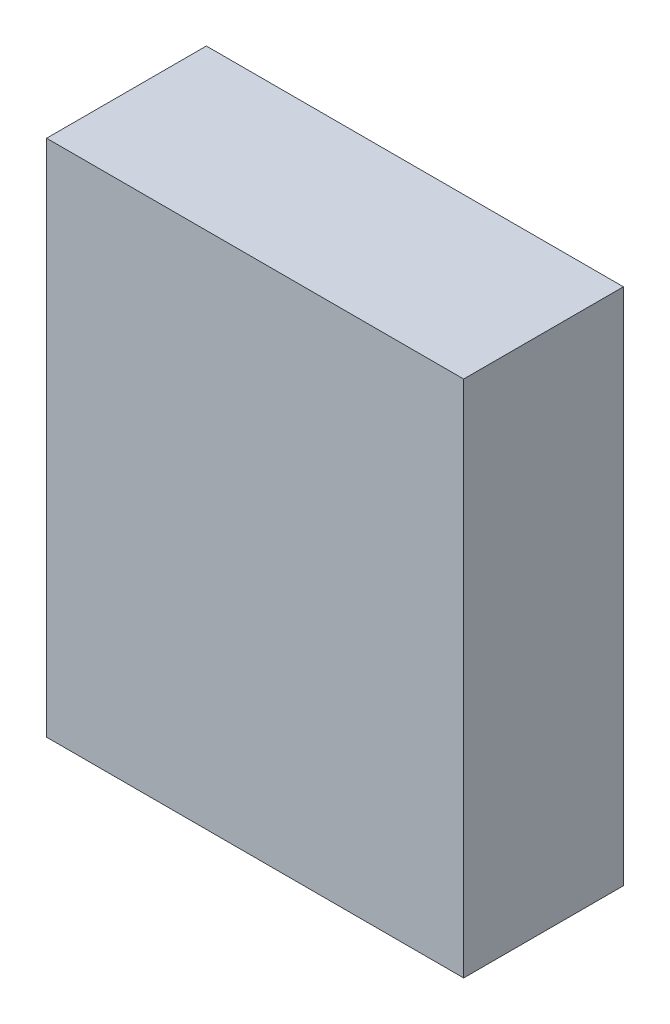
ISO-10303-21;
HEADER;
FILE_DESCRIPTION(('STEP AP214'),'2;1');
FILE_NAME('part.step','',(''),(''),'','','');
FILE_SCHEMA(('AUTOMOTIVE_DESIGN { 1 0 10303 214 1 1 1 1 }'));
ENDSEC;
DATA;
#1=APPLICATION_CONTEXT('core data for automotive mechanical design processes');
#2=APPLICATION_PROTOCOL_DEFINITION('international standard','automotive_design',2000,#1);
#3=PRODUCT_CONTEXT('',#1,'mechanical');
#4=PRODUCT('Part','Part','',(#3));
#5=PRODUCT_RELATED_PRODUCT_CATEGORY('part','',(#4));
#6=PRODUCT_DEFINITION_FORMATION('','',#4);
#7=PRODUCT_DEFINITION_CONTEXT('part definition',#1,'design');
#8=PRODUCT_DEFINITION('design','',#6,#7);
#9=PRODUCT_DEFINITION_SHAPE('','',#8);
#10=(LENGTH_UNIT() NAMED_UNIT(*) SI_UNIT(.MILLI.,.METRE.));
#11=(NAMED_UNIT(*) PLANE_ANGLE_UNIT() SI_UNIT($,.RADIAN.));
#12=(NAMED_UNIT(*) SI_UNIT($,.STERADIAN.) SOLID_ANGLE_UNIT());
#13=UNCERTAINTY_MEASURE_WITH_UNIT(LENGTH_MEASURE(1.E-05),#10,'distance_accuracy_value','');
#14=(GEOMETRIC_REPRESENTATION_CONTEXT(3) GLOBAL_UNCERTAINTY_ASSIGNED_CONTEXT((#13)) GLOBAL_UNIT_ASSIGNED_CONTEXT((#10,
#11,#12)) REPRESENTATION_CONTEXT('',''));
#15=CARTESIAN_POINT('',(0.,0.,0.));
#16=DIRECTION('',(0.,0.,1.));
#17=DIRECTION('',(1.,0.,0.));
#18=AXIS2_PLACEMENT_3D('',#15,#16,#17);
#19=CARTESIAN_POINT('',(-1.3055,-1.592,1.));
#20=DIRECTION('',(1.,0.,0.));
#21=DIRECTION('',(0.,0.,-1.));
#22=AXIS2_PLACEMENT_3D('',#19,#20,#21);
#23=PLANE('',#22);
#24=DIRECTION('',(0.,-1.,0.));
#25=VECTOR('',#24,1.);
#26=CARTESIAN_POINT('',(-1.3055,-1.592,0.));
#27=LINE('',#26,#25);
#28=CARTESIAN_POINT('',(-1.3055,1.6555,0.));
#29=VERTEX_POINT('',#28);
#30=CARTESIAN_POINT('',(-1.3055,-1.592,0.));
#31=VERTEX_POINT('',#30);
#32=EDGE_CURVE('E95',#29,#31,#27,.T.);
#33=ORIENTED_EDGE('',*,*,#32,.T.);
#34=DIRECTION('',(0.,0.,-1.));
#35=VECTOR('',#34,1.);
#36=CARTESIAN_POINT('',(-1.3055,-1.592,1.));
#37=LINE('',#36,#35);
#38=CARTESIAN_POINT('',(-1.3055,-1.592,1.));
#39=VERTEX_POINT('',#38);
#40=EDGE_CURVE('E11',#39,#31,#37,.T.);
#41=ORIENTED_EDGE('',*,*,#40,.F.);
#42=DIRECTION('',(0.,-1.,0.));
#43=VECTOR('',#42,1.);
#44=CARTESIAN_POINT('',(-1.3055,-1.592,1.));
#45=LINE('',#44,#43);
#46=CARTESIAN_POINT('',(-1.3055,1.6555,1.));
#47=VERTEX_POINT('',#46);
#48=EDGE_CURVE('E83',#47,#39,#45,.T.);
#49=ORIENTED_EDGE('',*,*,#48,.F.);
#50=DIRECTION('',(0.,0.,-1.));
#51=VECTOR('',#50,1.);
#52=CARTESIAN_POINT('',(-1.3055,1.6555,1.));
#53=LINE('',#52,#51);
#54=EDGE_CURVE('E91',#47,#29,#53,.T.);
#55=ORIENTED_EDGE('',*,*,#54,.T.);
#56=EDGE_LOOP('',(#33,#41,#49,#55));
#57=FACE_BOUND('',#56,.T.);
#58=ADVANCED_FACE('F32',(#57),#23,.F.);
#59=CARTESIAN_POINT('',(1.3055,-1.592,1.));
#60=DIRECTION('',(0.,1.,0.));
#61=DIRECTION('',(0.,0.,1.));
#62=AXIS2_PLACEMENT_3D('',#59,#60,#61);
#63=PLANE('',#62);
#64=DIRECTION('',(1.,0.,0.));
#65=VECTOR('',#64,1.);
#66=CARTESIAN_POINT('',(1.3055,-1.592,0.));
#67=LINE('',#66,#65);
#68=CARTESIAN_POINT('',(1.3055,-1.592,0.));
#69=VERTEX_POINT('',#68);
#70=EDGE_CURVE('E87',#31,#69,#67,.T.);
#71=ORIENTED_EDGE('',*,*,#70,.T.);
#72=DIRECTION('',(0.,0.,-1.));
#73=VECTOR('',#72,1.);
#74=CARTESIAN_POINT('',(1.3055,-1.592,1.));
#75=LINE('',#74,#73);
#76=CARTESIAN_POINT('',(1.3055,-1.592,1.));
#77=VERTEX_POINT('',#76);
#78=EDGE_CURVE('E40',#77,#69,#75,.T.);
#79=ORIENTED_EDGE('',*,*,#78,.F.);
#80=DIRECTION('',(1.,0.,0.));
#81=VECTOR('',#80,1.);
#82=CARTESIAN_POINT('',(1.3055,-1.592,1.));
#83=LINE('',#82,#81);
#84=EDGE_CURVE('E78',#39,#77,#83,.T.);
#85=ORIENTED_EDGE('',*,*,#84,.F.);
#86=ORIENTED_EDGE('',*,*,#40,.T.);
#87=EDGE_LOOP('',(#71,#79,#85,#86));
#88=FACE_BOUND('',#87,.T.);
#89=ADVANCED_FACE('F86',(#88),#63,.F.);
#90=CARTESIAN_POINT('',(1.3055,1.6555,1.));
#91=DIRECTION('',(-1.,0.,0.));
#92=DIRECTION('',(0.,0.,1.));
#93=AXIS2_PLACEMENT_3D('',#90,#91,#92);
#94=PLANE('',#93);
#95=DIRECTION('',(0.,1.,0.));
#96=VECTOR('',#95,1.);
#97=CARTESIAN_POINT('',(1.3055,1.6555,0.));
#98=LINE('',#97,#96);
#99=CARTESIAN_POINT('',(1.3055,1.6555,0.));
#100=VERTEX_POINT('',#99);
#101=EDGE_CURVE('E65',#69,#100,#98,.T.);
#102=ORIENTED_EDGE('',*,*,#101,.T.);
#103=DIRECTION('',(0.,0.,-1.));
#104=VECTOR('',#103,1.);
#105=CARTESIAN_POINT('',(1.3055,1.6555,1.));
#106=LINE('',#105,#104);
#107=CARTESIAN_POINT('',(1.3055,1.6555,1.));
#108=VERTEX_POINT('',#107);
#109=EDGE_CURVE('E88',#108,#100,#106,.T.);
#110=ORIENTED_EDGE('',*,*,#109,.F.);
#111=DIRECTION('',(0.,1.,0.));
#112=VECTOR('',#111,1.);
#113=CARTESIAN_POINT('',(1.3055,1.6555,1.));
#114=LINE('',#113,#112);
#115=EDGE_CURVE('E81',#77,#108,#114,.T.);
#116=ORIENTED_EDGE('',*,*,#115,.F.);
#117=ORIENTED_EDGE('',*,*,#78,.T.);
#118=EDGE_LOOP('',(#102,#110,#116,#117));
#119=FACE_BOUND('',#118,.T.);
#120=ADVANCED_FACE('F89',(#119),#94,.F.);
#121=CARTESIAN_POINT('',(-1.3055,1.6555,1.));
#122=DIRECTION('',(0.,-1.,0.));
#123=DIRECTION('',(0.,0.,-1.));
#124=AXIS2_PLACEMENT_3D('',#121,#122,#123);
#125=PLANE('',#124);
#126=DIRECTION('',(-1.,0.,0.));
#127=VECTOR('',#126,1.);
#128=CARTESIAN_POINT('',(-1.3055,1.6555,0.));
#129=LINE('',#128,#127);
#130=EDGE_CURVE('E71',#100,#29,#129,.T.);
#131=ORIENTED_EDGE('',*,*,#130,.T.);
#132=ORIENTED_EDGE('',*,*,#54,.F.);
#133=DIRECTION('',(-1.,0.,0.));
#134=VECTOR('',#133,1.);
#135=CARTESIAN_POINT('',(-1.3055,1.6555,1.));
#136=LINE('',#135,#134);
#137=EDGE_CURVE('E48',#108,#47,#136,.T.);
#138=ORIENTED_EDGE('',*,*,#137,.F.);
#139=ORIENTED_EDGE('',*,*,#109,.T.);
#140=EDGE_LOOP('',(#131,#132,#138,#139));
#141=FACE_BOUND('',#140,.T.);
#142=ADVANCED_FACE('F102',(#141),#125,.F.);
#143=CARTESIAN_POINT('',(0.,0.,1.));
#144=DIRECTION('',(0.,0.,-1.));
#145=DIRECTION('',(-1.,0.,0.));
#146=AXIS2_PLACEMENT_3D('',#143,#144,#145);
#147=PLANE('',#146);
#148=ORIENTED_EDGE('',*,*,#48,.T.);
#149=ORIENTED_EDGE('',*,*,#84,.T.);
#150=ORIENTED_EDGE('',*,*,#115,.T.);
#151=ORIENTED_EDGE('',*,*,#137,.T.);
#152=EDGE_LOOP('',(#148,#149,#150,#151));
#153=FACE_BOUND('',#152,.T.);
#154=ADVANCED_FACE('F79',(#153),#147,.F.);
#155=CARTESIAN_POINT('',(0.,0.,0.));
#156=DIRECTION('',(0.,0.,-1.));
#157=DIRECTION('',(-1.,0.,0.));
#158=AXIS2_PLACEMENT_3D('',#155,#156,#157);
#159=PLANE('',#158);
#160=ORIENTED_EDGE('',*,*,#32,.F.);
#161=ORIENTED_EDGE('',*,*,#130,.F.);
#162=ORIENTED_EDGE('',*,*,#101,.F.);
#163=ORIENTED_EDGE('',*,*,#70,.F.);
#164=EDGE_LOOP('',(#160,#161,#162,#163));
#165=FACE_BOUND('',#164,.T.);
#166=ADVANCED_FACE('F105',(#165),#159,.T.);
#167=CLOSED_SHELL('',(#58,#89,#120,#142,#154,#166));
#168=MANIFOLD_SOLID_BREP('B2',#167);
#169=ADVANCED_BREP_SHAPE_REPRESENTATION('',(#18,#168),#14);
#170=SHAPE_DEFINITION_REPRESENTATION(#9,#169);
ENDSEC;
END-ISO-10303-21;
